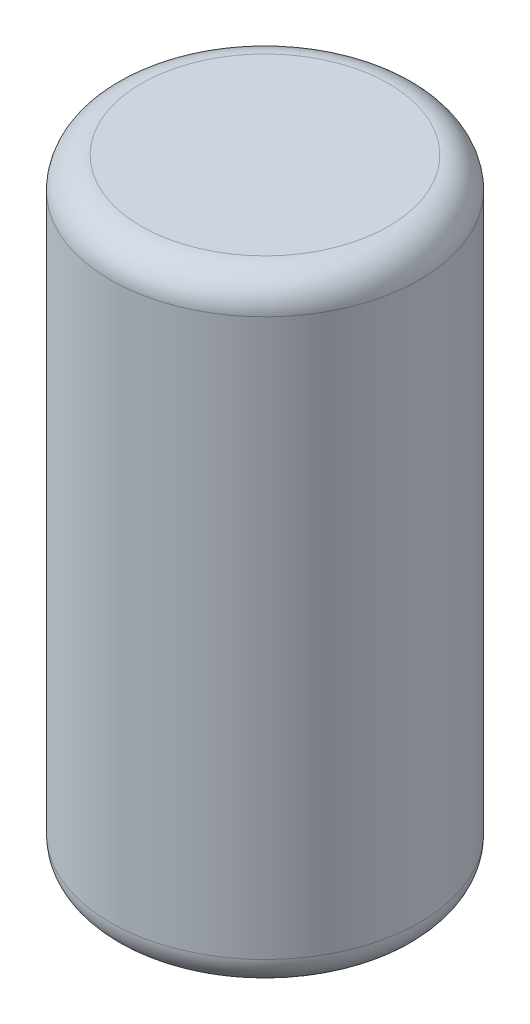
ISO-10303-21;
HEADER;
FILE_DESCRIPTION(('STEP AP214'),'2;1');
FILE_NAME('part.step','',(''),(''),'','','');
FILE_SCHEMA(('AUTOMOTIVE_DESIGN { 1 0 10303 214 1 1 1 1 }'));
ENDSEC;
DATA;
#1=APPLICATION_CONTEXT('core data for automotive mechanical design processes');
#2=APPLICATION_PROTOCOL_DEFINITION('international standard','automotive_design',2000,#1);
#3=PRODUCT_CONTEXT('',#1,'mechanical');
#4=PRODUCT('Part','Part','',(#3));
#5=PRODUCT_RELATED_PRODUCT_CATEGORY('part','',(#4));
#6=PRODUCT_DEFINITION_FORMATION('','',#4);
#7=PRODUCT_DEFINITION_CONTEXT('part definition',#1,'design');
#8=PRODUCT_DEFINITION('design','',#6,#7);
#9=PRODUCT_DEFINITION_SHAPE('','',#8);
#10=(LENGTH_UNIT() NAMED_UNIT(*) SI_UNIT(.MILLI.,.METRE.));
#11=(NAMED_UNIT(*) PLANE_ANGLE_UNIT() SI_UNIT($,.RADIAN.));
#12=(NAMED_UNIT(*) SI_UNIT($,.STERADIAN.) SOLID_ANGLE_UNIT());
#13=UNCERTAINTY_MEASURE_WITH_UNIT(LENGTH_MEASURE(1.E-05),#10,'distance_accuracy_value','');
#14=(GEOMETRIC_REPRESENTATION_CONTEXT(3) GLOBAL_UNCERTAINTY_ASSIGNED_CONTEXT((#13)) GLOBAL_UNIT_ASSIGNED_CONTEXT((#10,
#11,#12)) REPRESENTATION_CONTEXT('',''));
#15=CARTESIAN_POINT('',(0.,0.,0.));
#16=DIRECTION('',(0.,0.,1.));
#17=DIRECTION('',(1.,0.,0.));
#18=AXIS2_PLACEMENT_3D('',#15,#16,#17);
#19=CARTESIAN_POINT('',(0.,12.7,0.));
#20=DIRECTION('',(0.,-1.,0.));
#21=DIRECTION('',(0.,0.,-1.));
#22=AXIS2_PLACEMENT_3D('',#19,#20,#21);
#23=CYLINDRICAL_SURFACE('',#22,3.175);
#24=CARTESIAN_POINT('',(0.,0.635,0.));
#25=DIRECTION('',(0.,1.,0.));
#26=DIRECTION('',(0.,0.,1.));
#27=AXIS2_PLACEMENT_3D('',#24,#25,#26);
#28=CIRCLE('',#27,3.175);
#29=CARTESIAN_POINT('',(0.,0.635,3.175));
#30=VERTEX_POINT('',#29);
#31=EDGE_CURVE('E25',#30,#30,#28,.T.);
#32=ORIENTED_EDGE('',*,*,#31,.T.);
#33=EDGE_LOOP('',(#32));
#34=FACE_BOUND('',#33,.T.);
#35=CARTESIAN_POINT('',(0.,12.065,0.));
#36=DIRECTION('',(0.,1.,0.));
#37=DIRECTION('',(0.,0.,1.));
#38=AXIS2_PLACEMENT_3D('',#35,#36,#37);
#39=CIRCLE('',#38,3.175);
#40=CARTESIAN_POINT('',(0.,12.065,3.175));
#41=VERTEX_POINT('',#40);
#42=EDGE_CURVE('E29',#41,#41,#39,.F.);
#43=ORIENTED_EDGE('',*,*,#42,.T.);
#44=EDGE_LOOP('',(#43));
#45=FACE_BOUND('',#44,.T.);
#46=ADVANCED_FACE('F14',(#34,#45),#23,.T.);
#47=CARTESIAN_POINT('',(0.,12.7,0.));
#48=DIRECTION('',(0.,1.,0.));
#49=DIRECTION('',(0.,0.,1.));
#50=AXIS2_PLACEMENT_3D('',#47,#48,#49);
#51=PLANE('',#50);
#52=CARTESIAN_POINT('',(0.,12.7,0.));
#53=DIRECTION('',(0.,1.,0.));
#54=DIRECTION('',(0.,0.,1.));
#55=AXIS2_PLACEMENT_3D('',#52,#53,#54);
#56=CIRCLE('',#55,2.54);
#57=CARTESIAN_POINT('',(0.,12.7,2.54));
#58=VERTEX_POINT('',#57);
#59=EDGE_CURVE('E10',#58,#58,#56,.T.);
#60=ORIENTED_EDGE('',*,*,#59,.T.);
#61=EDGE_LOOP('',(#60));
#62=FACE_BOUND('',#61,.T.);
#63=ADVANCED_FACE('F47',(#62),#51,.T.);
#64=CARTESIAN_POINT('',(0.,0.,0.));
#65=DIRECTION('',(0.,1.,0.));
#66=DIRECTION('',(0.,0.,1.));
#67=AXIS2_PLACEMENT_3D('',#64,#65,#66);
#68=PLANE('',#67);
#69=CARTESIAN_POINT('',(0.,0.,0.));
#70=DIRECTION('',(0.,1.,0.));
#71=DIRECTION('',(0.,0.,1.));
#72=AXIS2_PLACEMENT_3D('',#69,#70,#71);
#73=CIRCLE('',#72,2.54);
#74=CARTESIAN_POINT('',(0.,0.,2.54));
#75=VERTEX_POINT('',#74);
#76=EDGE_CURVE('E21',#75,#75,#73,.F.);
#77=ORIENTED_EDGE('',*,*,#76,.T.);
#78=EDGE_LOOP('',(#77));
#79=FACE_BOUND('',#78,.T.);
#80=ADVANCED_FACE('F44',(#79),#68,.F.);
#81=CARTESIAN_POINT('',(0.,0.635,0.));
#82=DIRECTION('',(0.,1.,0.));
#83=DIRECTION('',(0.,0.,1.));
#84=AXIS2_PLACEMENT_3D('',#81,#82,#83);
#85=TOROIDAL_SURFACE('',#84,2.54,0.635);
#86=ORIENTED_EDGE('',*,*,#76,.F.);
#87=EDGE_LOOP('',(#86));
#88=FACE_BOUND('',#87,.T.);
#89=ORIENTED_EDGE('',*,*,#31,.F.);
#90=EDGE_LOOP('',(#89));
#91=FACE_BOUND('',#90,.T.);
#92=ADVANCED_FACE('F38',(#88,#91),#85,.T.);
#93=CARTESIAN_POINT('',(0.,12.065,0.));
#94=DIRECTION('',(0.,1.,0.));
#95=DIRECTION('',(0.,0.,1.));
#96=AXIS2_PLACEMENT_3D('',#93,#94,#95);
#97=TOROIDAL_SURFACE('',#96,2.54,0.635);
#98=ORIENTED_EDGE('',*,*,#42,.F.);
#99=EDGE_LOOP('',(#98));
#100=FACE_BOUND('',#99,.T.);
#101=ORIENTED_EDGE('',*,*,#59,.F.);
#102=EDGE_LOOP('',(#101));
#103=FACE_BOUND('',#102,.T.);
#104=ADVANCED_FACE('F16',(#100,#103),#97,.T.);
#105=CLOSED_SHELL('',(#46,#63,#80,#92,#104));
#106=MANIFOLD_SOLID_BREP('B1',#105);
#107=ADVANCED_BREP_SHAPE_REPRESENTATION('',(#18,#106),#14);
#108=SHAPE_DEFINITION_REPRESENTATION(#9,#107);
ENDSEC;
END-ISO-10303-21;
